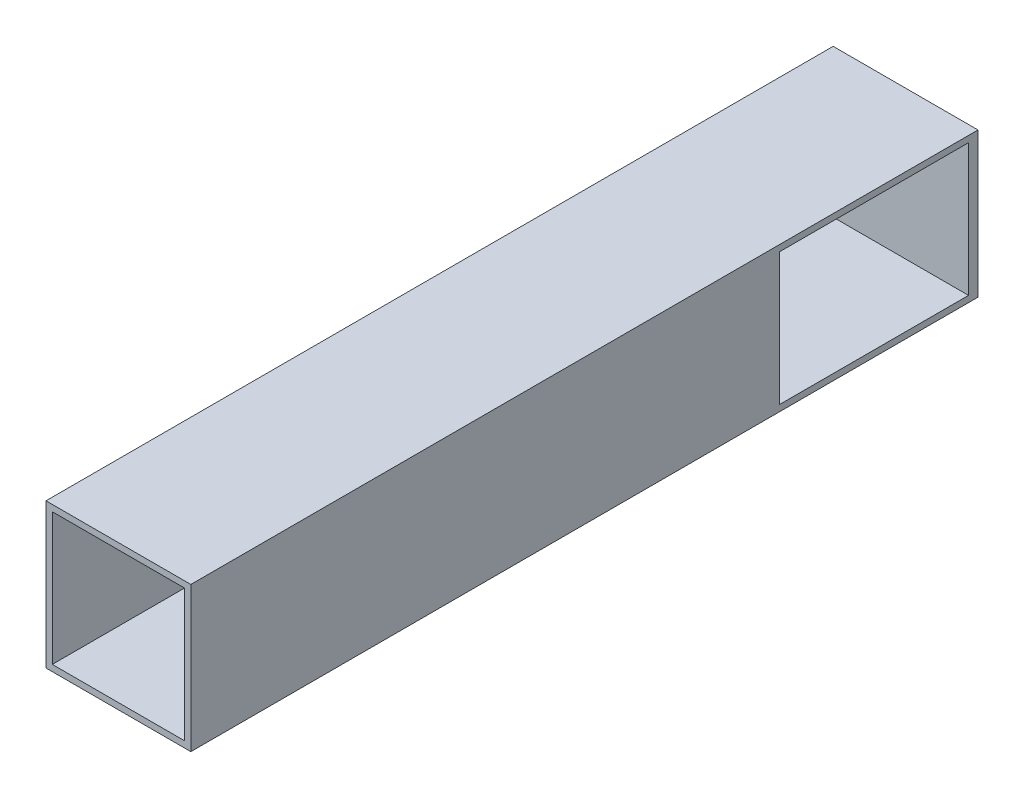
ISO-10303-21;
HEADER;
FILE_DESCRIPTION(('STEP AP214'),'2;1');
FILE_NAME('part.step','',(''),(''),'','','');
FILE_SCHEMA(('AUTOMOTIVE_DESIGN { 1 0 10303 214 1 1 1 1 }'));
ENDSEC;
DATA;
#1=APPLICATION_CONTEXT('core data for automotive mechanical design processes');
#2=APPLICATION_PROTOCOL_DEFINITION('international standard','automotive_design',2000,#1);
#3=PRODUCT_CONTEXT('',#1,'mechanical');
#4=PRODUCT('Part','Part','',(#3));
#5=PRODUCT_RELATED_PRODUCT_CATEGORY('part','',(#4));
#6=PRODUCT_DEFINITION_FORMATION('','',#4);
#7=PRODUCT_DEFINITION_CONTEXT('part definition',#1,'design');
#8=PRODUCT_DEFINITION('design','',#6,#7);
#9=PRODUCT_DEFINITION_SHAPE('','',#8);
#10=(LENGTH_UNIT() NAMED_UNIT(*) SI_UNIT(.MILLI.,.METRE.));
#11=(NAMED_UNIT(*) PLANE_ANGLE_UNIT() SI_UNIT($,.RADIAN.));
#12=(NAMED_UNIT(*) SI_UNIT($,.STERADIAN.) SOLID_ANGLE_UNIT());
#13=UNCERTAINTY_MEASURE_WITH_UNIT(LENGTH_MEASURE(1.E-05),#10,'distance_accuracy_value','');
#14=(GEOMETRIC_REPRESENTATION_CONTEXT(3) GLOBAL_UNCERTAINTY_ASSIGNED_CONTEXT((#13)) GLOBAL_UNIT_ASSIGNED_CONTEXT((#10,
#11,#12)) REPRESENTATION_CONTEXT('',''));
#15=CARTESIAN_POINT('',(0.,0.,0.));
#16=DIRECTION('',(0.,0.,1.));
#17=DIRECTION('',(1.,0.,0.));
#18=AXIS2_PLACEMENT_3D('',#15,#16,#17);
#19=CARTESIAN_POINT('',(13.6309958016777,15.2898102048579,635.));
#20=DIRECTION('',(1.,0.,0.));
#21=DIRECTION('',(0.,0.,-1.));
#22=AXIS2_PLACEMENT_3D('',#19,#20,#21);
#23=PLANE('',#22);
#24=DIRECTION('',(0.,-1.,0.));
#25=VECTOR('',#24,1.);
#26=CARTESIAN_POINT('',(13.6309958016777,15.2898102048579,0.));
#27=LINE('',#26,#25);
#28=CARTESIAN_POINT('',(13.6309958016777,15.2898102048579,0.));
#29=VERTEX_POINT('',#28);
#30=CARTESIAN_POINT('',(13.6309958016777,-101.550189795142,0.));
#31=VERTEX_POINT('',#30);
#32=EDGE_CURVE('E162',#29,#31,#27,.T.);
#33=ORIENTED_EDGE('',*,*,#32,.T.);
#34=DIRECTION('',(0.,0.,-1.));
#35=VECTOR('',#34,1.);
#36=CARTESIAN_POINT('',(13.6309958016777,-101.550189795142,635.));
#37=LINE('',#36,#35);
#38=CARTESIAN_POINT('',(13.6309958016777,-101.550189795142,635.));
#39=VERTEX_POINT('',#38);
#40=EDGE_CURVE('E11',#39,#31,#37,.T.);
#41=ORIENTED_EDGE('',*,*,#40,.F.);
#42=DIRECTION('',(0.,-1.,0.));
#43=VECTOR('',#42,1.);
#44=CARTESIAN_POINT('',(13.6309958016777,15.2898102048579,635.));
#45=LINE('',#44,#43);
#46=CARTESIAN_POINT('',(13.6309958016777,15.2898102048579,635.));
#47=VERTEX_POINT('',#46);
#48=EDGE_CURVE('E169',#47,#39,#45,.T.);
#49=ORIENTED_EDGE('',*,*,#48,.F.);
#50=DIRECTION('',(0.,0.,-1.));
#51=VECTOR('',#50,1.);
#52=CARTESIAN_POINT('',(13.6309958016777,15.2898102048579,635.));
#53=LINE('',#52,#51);
#54=EDGE_CURVE('E179',#47,#29,#53,.T.);
#55=ORIENTED_EDGE('',*,*,#54,.T.);
#56=EDGE_LOOP('',(#33,#41,#49,#55));
#57=FACE_BOUND('',#56,.T.);
#58=ADVANCED_FACE('F42',(#57),#23,.F.);
#59=CARTESIAN_POINT('',(13.6309958016777,-101.550189795142,635.));
#60=DIRECTION('',(0.,1.,0.));
#61=DIRECTION('',(-1.,0.,0.));
#62=AXIS2_PLACEMENT_3D('',#59,#60,#61);
#63=PLANE('',#62);
#64=DIRECTION('',(1.,0.,0.));
#65=VECTOR('',#64,1.);
#66=CARTESIAN_POINT('',(13.6309958016777,-101.550189795142,0.));
#67=LINE('',#66,#65);
#68=CARTESIAN_POINT('',(130.470995801678,-101.550189795142,0.));
#69=VERTEX_POINT('',#68);
#70=EDGE_CURVE('E182',#31,#69,#67,.T.);
#71=ORIENTED_EDGE('',*,*,#70,.T.);
#72=DIRECTION('',(0.,0.,-1.));
#73=VECTOR('',#72,1.);
#74=CARTESIAN_POINT('',(130.470995801678,-101.550189795142,635.));
#75=LINE('',#74,#73);
#76=CARTESIAN_POINT('',(130.470995801678,-101.550189795142,635.));
#77=VERTEX_POINT('',#76);
#78=EDGE_CURVE('E49',#77,#69,#75,.T.);
#79=ORIENTED_EDGE('',*,*,#78,.F.);
#80=DIRECTION('',(1.,0.,0.));
#81=VECTOR('',#80,1.);
#82=CARTESIAN_POINT('',(13.6309958016777,-101.550189795142,635.));
#83=LINE('',#82,#81);
#84=EDGE_CURVE('E172',#39,#77,#83,.T.);
#85=ORIENTED_EDGE('',*,*,#84,.F.);
#86=ORIENTED_EDGE('',*,*,#40,.T.);
#87=EDGE_LOOP('',(#71,#79,#85,#86));
#88=FACE_BOUND('',#87,.T.);
#89=ADVANCED_FACE('F210',(#88),#63,.F.);
#90=CARTESIAN_POINT('',(130.470995801678,15.2898102048579,635.));
#91=DIRECTION('',(-1.,0.,0.));
#92=DIRECTION('',(0.,0.,1.));
#93=AXIS2_PLACEMENT_3D('',#90,#91,#92);
#94=PLANE('',#93);
#95=DIRECTION('',(0.,0.,1.));
#96=VECTOR('',#95,1.);
#97=CARTESIAN_POINT('',(130.470995801678,10.2098102048579,160.02));
#98=LINE('',#97,#96);
#99=CARTESIAN_POINT('',(130.470995801678,10.2098102048579,7.62000000000007));
#100=VERTEX_POINT('',#99);
#101=CARTESIAN_POINT('',(130.470995801678,10.2098102048579,160.02));
#102=VERTEX_POINT('',#101);
#103=EDGE_CURVE('E127',#100,#102,#98,.T.);
#104=ORIENTED_EDGE('',*,*,#103,.F.);
#105=DIRECTION('',(0.,1.,0.));
#106=VECTOR('',#105,1.);
#107=CARTESIAN_POINT('',(130.470995801678,-96.4701897951421,7.62));
#108=LINE('',#107,#106);
#109=CARTESIAN_POINT('',(130.470995801678,-96.4701897951421,7.62));
#110=VERTEX_POINT('',#109);
#111=EDGE_CURVE('E131',#110,#100,#108,.T.);
#112=ORIENTED_EDGE('',*,*,#111,.F.);
#113=DIRECTION('',(0.,0.,-1.));
#114=VECTOR('',#113,1.);
#115=CARTESIAN_POINT('',(130.470995801678,-96.4701897951421,7.62));
#116=LINE('',#115,#114);
#117=CARTESIAN_POINT('',(130.470995801678,-96.4701897951421,160.02));
#118=VERTEX_POINT('',#117);
#119=EDGE_CURVE('E124',#118,#110,#116,.T.);
#120=ORIENTED_EDGE('',*,*,#119,.F.);
#121=DIRECTION('',(0.,-1.,0.));
#122=VECTOR('',#121,1.);
#123=CARTESIAN_POINT('',(130.470995801678,-96.4701897951421,160.02));
#124=LINE('',#123,#122);
#125=EDGE_CURVE('E118',#102,#118,#124,.T.);
#126=ORIENTED_EDGE('',*,*,#125,.F.);
#127=EDGE_LOOP('',(#104,#112,#120,#126));
#128=FACE_BOUND('',#127,.T.);
#129=DIRECTION('',(0.,1.,0.));
#130=VECTOR('',#129,1.);
#131=CARTESIAN_POINT('',(130.470995801678,15.2898102048579,0.));
#132=LINE('',#131,#130);
#133=CARTESIAN_POINT('',(130.470995801678,15.2898102048579,0.));
#134=VERTEX_POINT('',#133);
#135=EDGE_CURVE('E184',#69,#134,#132,.T.);
#136=ORIENTED_EDGE('',*,*,#135,.T.);
#137=DIRECTION('',(0.,0.,-1.));
#138=VECTOR('',#137,1.);
#139=CARTESIAN_POINT('',(130.470995801678,15.2898102048579,635.));
#140=LINE('',#139,#138);
#141=CARTESIAN_POINT('',(130.470995801678,15.2898102048579,635.));
#142=VERTEX_POINT('',#141);
#143=EDGE_CURVE('E189',#142,#134,#140,.T.);
#144=ORIENTED_EDGE('',*,*,#143,.F.);
#145=DIRECTION('',(0.,1.,0.));
#146=VECTOR('',#145,1.);
#147=CARTESIAN_POINT('',(130.470995801678,15.2898102048579,635.));
#148=LINE('',#147,#146);
#149=EDGE_CURVE('E175',#77,#142,#148,.T.);
#150=ORIENTED_EDGE('',*,*,#149,.F.);
#151=ORIENTED_EDGE('',*,*,#78,.T.);
#152=EDGE_LOOP('',(#136,#144,#150,#151));
#153=FACE_BOUND('',#152,.T.);
#154=ADVANCED_FACE('F133',(#128,#153),#94,.F.);
#155=CARTESIAN_POINT('',(13.6309958016777,15.2898102048579,635.));
#156=DIRECTION('',(0.,-1.,0.));
#157=DIRECTION('',(0.,0.,-1.));
#158=AXIS2_PLACEMENT_3D('',#155,#156,#157);
#159=PLANE('',#158);
#160=DIRECTION('',(-1.,0.,0.));
#161=VECTOR('',#160,1.);
#162=CARTESIAN_POINT('',(13.6309958016777,15.2898102048579,0.));
#163=LINE('',#162,#161);
#164=EDGE_CURVE('E173',#134,#29,#163,.T.);
#165=ORIENTED_EDGE('',*,*,#164,.T.);
#166=ORIENTED_EDGE('',*,*,#54,.F.);
#167=DIRECTION('',(-1.,0.,0.));
#168=VECTOR('',#167,1.);
#169=CARTESIAN_POINT('',(13.6309958016777,15.2898102048579,635.));
#170=LINE('',#169,#168);
#171=EDGE_CURVE('E177',#142,#47,#170,.T.);
#172=ORIENTED_EDGE('',*,*,#171,.F.);
#173=ORIENTED_EDGE('',*,*,#143,.T.);
#174=EDGE_LOOP('',(#165,#166,#172,#173));
#175=FACE_BOUND('',#174,.T.);
#176=ADVANCED_FACE('F203',(#175),#159,.F.);
#177=CARTESIAN_POINT('',(0.,0.,635.));
#178=DIRECTION('',(0.,0.,1.));
#179=DIRECTION('',(1.,0.,0.));
#180=AXIS2_PLACEMENT_3D('',#177,#178,#179);
#181=PLANE('',#180);
#182=DIRECTION('',(0.,-1.,0.));
#183=VECTOR('',#182,1.);
#184=CARTESIAN_POINT('',(18.7109958016777,-96.4701897951421,635.));
#185=LINE('',#184,#183);
#186=CARTESIAN_POINT('',(18.7109958016777,10.2098102048579,635.));
#187=VERTEX_POINT('',#186);
#188=CARTESIAN_POINT('',(18.7109958016777,-96.4701897951421,635.));
#189=VERTEX_POINT('',#188);
#190=EDGE_CURVE('E142',#187,#189,#185,.T.);
#191=ORIENTED_EDGE('',*,*,#190,.F.);
#192=DIRECTION('',(-1.,0.,0.));
#193=VECTOR('',#192,1.);
#194=CARTESIAN_POINT('',(18.7109958016777,10.2098102048579,635.));
#195=LINE('',#194,#193);
#196=CARTESIAN_POINT('',(125.390995801678,10.2098102048579,635.));
#197=VERTEX_POINT('',#196);
#198=EDGE_CURVE('E147',#197,#187,#195,.T.);
#199=ORIENTED_EDGE('',*,*,#198,.F.);
#200=DIRECTION('',(0.,1.,0.));
#201=VECTOR('',#200,1.);
#202=CARTESIAN_POINT('',(125.390995801678,-96.4701897951421,635.));
#203=LINE('',#202,#201);
#204=CARTESIAN_POINT('',(125.390995801678,-96.4701897951421,635.));
#205=VERTEX_POINT('',#204);
#206=EDGE_CURVE('E155',#205,#197,#203,.T.);
#207=ORIENTED_EDGE('',*,*,#206,.F.);
#208=DIRECTION('',(1.,0.,0.));
#209=VECTOR('',#208,1.);
#210=CARTESIAN_POINT('',(18.7109958016777,-96.4701897951421,635.));
#211=LINE('',#210,#209);
#212=EDGE_CURVE('E152',#189,#205,#211,.T.);
#213=ORIENTED_EDGE('',*,*,#212,.F.);
#214=EDGE_LOOP('',(#191,#199,#207,#213));
#215=FACE_BOUND('',#214,.T.);
#216=ORIENTED_EDGE('',*,*,#48,.T.);
#217=ORIENTED_EDGE('',*,*,#84,.T.);
#218=ORIENTED_EDGE('',*,*,#149,.T.);
#219=ORIENTED_EDGE('',*,*,#171,.T.);
#220=EDGE_LOOP('',(#216,#217,#218,#219));
#221=FACE_BOUND('',#220,.T.);
#222=ADVANCED_FACE('F209',(#215,#221),#181,.T.);
#223=CARTESIAN_POINT('',(0.,0.,0.));
#224=DIRECTION('',(0.,0.,1.));
#225=DIRECTION('',(1.,0.,0.));
#226=AXIS2_PLACEMENT_3D('',#223,#224,#225);
#227=PLANE('',#226);
#228=ORIENTED_EDGE('',*,*,#32,.F.);
#229=ORIENTED_EDGE('',*,*,#164,.F.);
#230=ORIENTED_EDGE('',*,*,#135,.F.);
#231=ORIENTED_EDGE('',*,*,#70,.F.);
#232=EDGE_LOOP('',(#228,#229,#230,#231));
#233=FACE_BOUND('',#232,.T.);
#234=ADVANCED_FACE('F200',(#233),#227,.F.);
#235=CARTESIAN_POINT('',(18.7109958016777,-96.4701897951421,7.62000000000007));
#236=DIRECTION('',(-1.,0.,0.));
#237=DIRECTION('',(0.,0.,1.));
#238=AXIS2_PLACEMENT_3D('',#235,#236,#237);
#239=PLANE('',#238);
#240=ORIENTED_EDGE('',*,*,#190,.T.);
#241=DIRECTION('',(0.,0.,1.));
#242=VECTOR('',#241,1.);
#243=CARTESIAN_POINT('',(18.7109958016777,-96.4701897951421,7.62000000000007));
#244=LINE('',#243,#242);
#245=CARTESIAN_POINT('',(18.7109958016777,-96.4701897951421,7.62000000000007));
#246=VERTEX_POINT('',#245);
#247=EDGE_CURVE('E150',#246,#189,#244,.T.);
#248=ORIENTED_EDGE('',*,*,#247,.F.);
#249=DIRECTION('',(0.,-1.,0.));
#250=VECTOR('',#249,1.);
#251=CARTESIAN_POINT('',(18.7109958016777,-96.4701897951421,7.62000000000007));
#252=LINE('',#251,#250);
#253=CARTESIAN_POINT('',(18.7109958016777,10.2098102048579,7.62000000000007));
#254=VERTEX_POINT('',#253);
#255=EDGE_CURVE('E143',#254,#246,#252,.T.);
#256=ORIENTED_EDGE('',*,*,#255,.F.);
#257=DIRECTION('',(0.,0.,1.));
#258=VECTOR('',#257,1.);
#259=CARTESIAN_POINT('',(18.7109958016777,10.2098102048579,7.62000000000007));
#260=LINE('',#259,#258);
#261=EDGE_CURVE('E160',#254,#187,#260,.T.);
#262=ORIENTED_EDGE('',*,*,#261,.T.);
#263=EDGE_LOOP('',(#240,#248,#256,#262));
#264=FACE_BOUND('',#263,.T.);
#265=ADVANCED_FACE('F224',(#264),#239,.F.);
#266=CARTESIAN_POINT('',(18.7109958016777,10.2098102048579,7.62000000000007));
#267=DIRECTION('',(0.,1.,0.));
#268=DIRECTION('',(-1.,0.,0.));
#269=AXIS2_PLACEMENT_3D('',#266,#267,#268);
#270=PLANE('',#269);
#271=DIRECTION('',(1.,0.,0.));
#272=VECTOR('',#271,1.);
#273=CARTESIAN_POINT('',(122.850995801678,10.2098102048579,160.02));
#274=LINE('',#273,#272);
#275=CARTESIAN_POINT('',(125.390995801678,10.2098102048579,160.02));
#276=VERTEX_POINT('',#275);
#277=EDGE_CURVE('E62',#276,#102,#274,.T.);
#278=ORIENTED_EDGE('',*,*,#277,.F.);
#279=DIRECTION('',(0.,0.,1.));
#280=VECTOR('',#279,1.);
#281=CARTESIAN_POINT('',(125.390995801678,10.2098102048579,7.62000000000007));
#282=LINE('',#281,#280);
#283=EDGE_CURVE('E163',#276,#197,#282,.T.);
#284=ORIENTED_EDGE('',*,*,#283,.T.);
#285=ORIENTED_EDGE('',*,*,#198,.T.);
#286=ORIENTED_EDGE('',*,*,#261,.F.);
#287=DIRECTION('',(-1.,0.,0.));
#288=VECTOR('',#287,1.);
#289=CARTESIAN_POINT('',(18.7109958016777,10.2098102048579,7.62000000000007));
#290=LINE('',#289,#288);
#291=EDGE_CURVE('E56',#100,#254,#290,.T.);
#292=ORIENTED_EDGE('',*,*,#291,.F.);
#293=ORIENTED_EDGE('',*,*,#103,.T.);
#294=EDGE_LOOP('',(#278,#284,#285,#286,#292,#293));
#295=FACE_BOUND('',#294,.T.);
#296=ADVANCED_FACE('F128',(#295),#270,.F.);
#297=CARTESIAN_POINT('',(125.390995801678,-96.4701897951421,7.62000000000007));
#298=DIRECTION('',(1.,0.,0.));
#299=DIRECTION('',(0.,0.,-1.));
#300=AXIS2_PLACEMENT_3D('',#297,#298,#299);
#301=PLANE('',#300);
#302=ORIENTED_EDGE('',*,*,#283,.F.);
#303=DIRECTION('',(0.,-1.,0.));
#304=VECTOR('',#303,1.);
#305=CARTESIAN_POINT('',(125.390995801678,-96.4701897951421,160.02));
#306=LINE('',#305,#304);
#307=CARTESIAN_POINT('',(125.390995801678,-96.4701897951421,160.02));
#308=VERTEX_POINT('',#307);
#309=EDGE_CURVE('E121',#276,#308,#306,.T.);
#310=ORIENTED_EDGE('',*,*,#309,.T.);
#311=DIRECTION('',(0.,0.,1.));
#312=VECTOR('',#311,1.);
#313=CARTESIAN_POINT('',(125.390995801678,-96.4701897951421,7.62000000000007));
#314=LINE('',#313,#312);
#315=EDGE_CURVE('E165',#308,#205,#314,.T.);
#316=ORIENTED_EDGE('',*,*,#315,.T.);
#317=ORIENTED_EDGE('',*,*,#206,.T.);
#318=EDGE_LOOP('',(#302,#310,#316,#317));
#319=FACE_BOUND('',#318,.T.);
#320=ADVANCED_FACE('F235',(#319),#301,.F.);
#321=CARTESIAN_POINT('',(18.7109958016777,-96.4701897951421,7.62000000000007));
#322=DIRECTION('',(0.,-1.,0.));
#323=DIRECTION('',(0.,0.,-1.));
#324=AXIS2_PLACEMENT_3D('',#321,#322,#323);
#325=PLANE('',#324);
#326=ORIENTED_EDGE('',*,*,#315,.F.);
#327=DIRECTION('',(1.,0.,0.));
#328=VECTOR('',#327,1.);
#329=CARTESIAN_POINT('',(122.850995801678,-96.4701897951421,160.02));
#330=LINE('',#329,#328);
#331=EDGE_CURVE('E123',#308,#118,#330,.T.);
#332=ORIENTED_EDGE('',*,*,#331,.T.);
#333=ORIENTED_EDGE('',*,*,#119,.T.);
#334=DIRECTION('',(1.,0.,0.));
#335=VECTOR('',#334,1.);
#336=CARTESIAN_POINT('',(18.7109958016777,-96.4701897951421,7.62000000000007));
#337=LINE('',#336,#335);
#338=EDGE_CURVE('E146',#246,#110,#337,.T.);
#339=ORIENTED_EDGE('',*,*,#338,.F.);
#340=ORIENTED_EDGE('',*,*,#247,.T.);
#341=ORIENTED_EDGE('',*,*,#212,.T.);
#342=EDGE_LOOP('',(#326,#332,#333,#339,#340,#341));
#343=FACE_BOUND('',#342,.T.);
#344=ADVANCED_FACE('F231',(#343),#325,.F.);
#345=CARTESIAN_POINT('',(0.,0.,7.62000000000007));
#346=DIRECTION('',(0.,0.,-1.));
#347=DIRECTION('',(-1.,0.,0.));
#348=AXIS2_PLACEMENT_3D('',#345,#346,#347);
#349=PLANE('',#348);
#350=ORIENTED_EDGE('',*,*,#338,.T.);
#351=ORIENTED_EDGE('',*,*,#111,.T.);
#352=ORIENTED_EDGE('',*,*,#291,.T.);
#353=ORIENTED_EDGE('',*,*,#255,.T.);
#354=EDGE_LOOP('',(#350,#351,#352,#353));
#355=FACE_BOUND('',#354,.T.);
#356=ADVANCED_FACE('F234',(#355),#349,.F.);
#357=CARTESIAN_POINT('',(122.850995801678,-96.4701897951421,160.02));
#358=DIRECTION('',(0.,0.,1.));
#359=DIRECTION('',(1.,0.,0.));
#360=AXIS2_PLACEMENT_3D('',#357,#358,#359);
#361=PLANE('',#360);
#362=ORIENTED_EDGE('',*,*,#277,.T.);
#363=ORIENTED_EDGE('',*,*,#125,.T.);
#364=ORIENTED_EDGE('',*,*,#331,.F.);
#365=ORIENTED_EDGE('',*,*,#309,.F.);
#366=EDGE_LOOP('',(#362,#363,#364,#365));
#367=FACE_BOUND('',#366,.T.);
#368=ADVANCED_FACE('F116',(#367),#361,.F.);
#369=CLOSED_SHELL('',(#58,#89,#154,#176,#222,#234,#265,#296,#320,#344,#356,#368));
#370=MANIFOLD_SOLID_BREP('B2',#369);
#371=ADVANCED_BREP_SHAPE_REPRESENTATION('',(#18,#370),#14);
#372=SHAPE_DEFINITION_REPRESENTATION(#9,#371);
ENDSEC;
END-ISO-10303-21;
